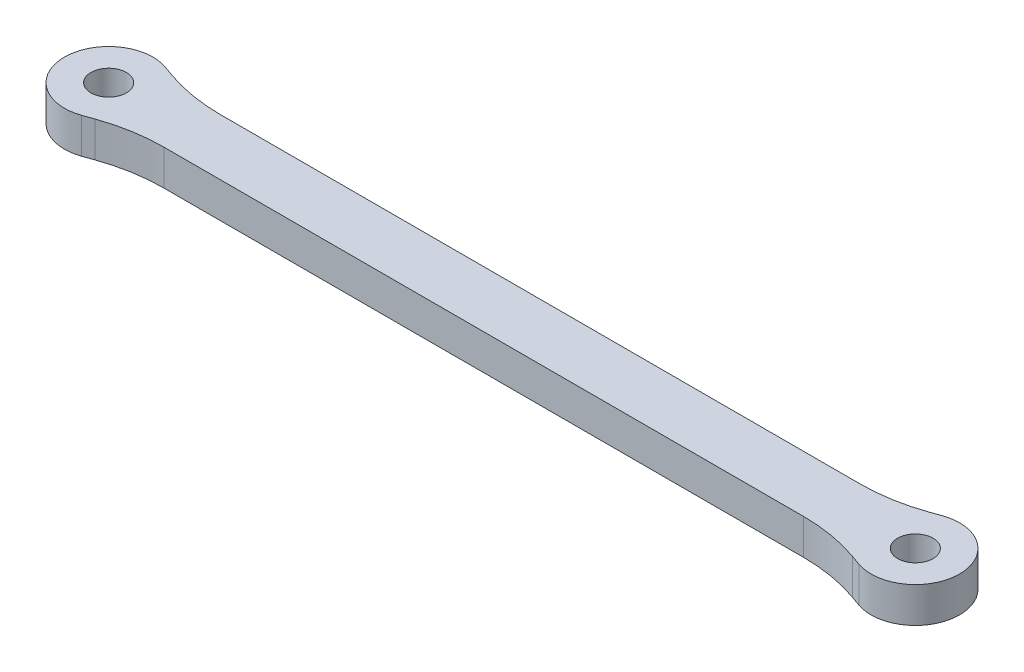
ISO-10303-21;
HEADER;
FILE_DESCRIPTION(('STEP AP214'),'2;1');
FILE_NAME('part.step','',(''),(''),'','','');
FILE_SCHEMA(('AUTOMOTIVE_DESIGN { 1 0 10303 214 1 1 1 1 }'));
ENDSEC;
DATA;
#1=APPLICATION_CONTEXT('core data for automotive mechanical design processes');
#2=APPLICATION_PROTOCOL_DEFINITION('international standard','automotive_design',2000,#1);
#3=PRODUCT_CONTEXT('',#1,'mechanical');
#4=PRODUCT('Part','Part','',(#3));
#5=PRODUCT_RELATED_PRODUCT_CATEGORY('part','',(#4));
#6=PRODUCT_DEFINITION_FORMATION('','',#4);
#7=PRODUCT_DEFINITION_CONTEXT('part definition',#1,'design');
#8=PRODUCT_DEFINITION('design','',#6,#7);
#9=PRODUCT_DEFINITION_SHAPE('','',#8);
#10=(LENGTH_UNIT() NAMED_UNIT(*) SI_UNIT(.MILLI.,.METRE.));
#11=(NAMED_UNIT(*) PLANE_ANGLE_UNIT() SI_UNIT($,.RADIAN.));
#12=(NAMED_UNIT(*) SI_UNIT($,.STERADIAN.) SOLID_ANGLE_UNIT());
#13=UNCERTAINTY_MEASURE_WITH_UNIT(LENGTH_MEASURE(1.E-05),#10,'distance_accuracy_value','');
#14=(GEOMETRIC_REPRESENTATION_CONTEXT(3) GLOBAL_UNCERTAINTY_ASSIGNED_CONTEXT((#13)) GLOBAL_UNIT_ASSIGNED_CONTEXT((#10,
#11,#12)) REPRESENTATION_CONTEXT('',''));
#15=CARTESIAN_POINT('',(0.,0.,0.));
#16=DIRECTION('',(0.,0.,1.));
#17=DIRECTION('',(1.,0.,0.));
#18=AXIS2_PLACEMENT_3D('',#15,#16,#17);
#19=CARTESIAN_POINT('',(45.5,2.,0.));
#20=DIRECTION('',(0.,1.,0.));
#21=DIRECTION('',(0.,0.,1.));
#22=AXIS2_PLACEMENT_3D('',#19,#20,#21);
#23=PLANE('',#22);
#24=CARTESIAN_POINT('',(0.,2.,0.));
#25=DIRECTION('',(0.,1.,0.));
#26=DIRECTION('',(0.,0.,1.));
#27=AXIS2_PLACEMENT_3D('',#24,#25,#26);
#28=CIRCLE('',#27,1.);
#29=CARTESIAN_POINT('',(0.,2.,1.));
#30=VERTEX_POINT('',#29);
#31=EDGE_CURVE('E170',#30,#30,#28,.T.);
#32=ORIENTED_EDGE('',*,*,#31,.F.);
#33=EDGE_LOOP('',(#32));
#34=FACE_BOUND('',#33,.T.);
#35=DIRECTION('',(-0.942809041582064,0.,0.333333333333332));
#36=VECTOR('',#35,1.);
#37=CARTESIAN_POINT('',(42.4996441995921,2.,-1.59086446322915));
#38=LINE('',#37,#36);
#39=CARTESIAN_POINT('',(44.6666666666667,2.,-2.35702260395516));
#40=VERTEX_POINT('',#39);
#41=CARTESIAN_POINT('',(44.1172487803873,2.,-2.16277404740851));
#42=VERTEX_POINT('',#41);
#43=EDGE_CURVE('E164',#40,#42,#38,.T.);
#44=ORIENTED_EDGE('',*,*,#43,.T.);
#45=CARTESIAN_POINT('',(40.783915447054,2.,-11.5908644632291));
#46=DIRECTION('',(0.,1.,0.));
#47=DIRECTION('',(0.,0.,1.));
#48=AXIS2_PLACEMENT_3D('',#45,#46,#47);
#49=CIRCLE('',#48,10.);
#50=CARTESIAN_POINT('',(40.783915447054,2.,-1.59086446322915));
#51=VERTEX_POINT('',#50);
#52=EDGE_CURVE('E215',#42,#51,#49,.F.);
#53=ORIENTED_EDGE('',*,*,#52,.T.);
#54=DIRECTION('',(-1.,0.,0.));
#55=VECTOR('',#54,1.);
#56=CARTESIAN_POINT('',(3.00035580040789,2.,-1.59086446322915));
#57=LINE('',#56,#55);
#58=CARTESIAN_POINT('',(4.71608455294599,2.,-1.59086446322915));
#59=VERTEX_POINT('',#58);
#60=EDGE_CURVE('E138',#51,#59,#57,.T.);
#61=ORIENTED_EDGE('',*,*,#60,.T.);
#62=CARTESIAN_POINT('',(4.71608455294599,2.,-11.5908644632291));
#63=DIRECTION('',(0.,1.,0.));
#64=DIRECTION('',(0.,0.,1.));
#65=AXIS2_PLACEMENT_3D('',#62,#63,#64);
#66=CIRCLE('',#65,10.);
#67=CARTESIAN_POINT('',(1.38275121961265,2.,-2.16277404740852));
#68=VERTEX_POINT('',#67);
#69=EDGE_CURVE('E134',#59,#68,#66,.F.);
#70=ORIENTED_EDGE('',*,*,#69,.T.);
#71=DIRECTION('',(-0.942809041582063,0.,-0.333333333333333));
#72=VECTOR('',#71,1.);
#73=CARTESIAN_POINT('',(0.833333333333333,2.,-2.35702260395516));
#74=LINE('',#73,#72);
#75=CARTESIAN_POINT('',(0.833333333333333,2.,-2.35702260395516));
#76=VERTEX_POINT('',#75);
#77=EDGE_CURVE('E125',#68,#76,#74,.T.);
#78=ORIENTED_EDGE('',*,*,#77,.T.);
#79=CARTESIAN_POINT('',(0.,2.,0.));
#80=DIRECTION('',(0.,1.,0.));
#81=DIRECTION('',(0.,0.,1.));
#82=AXIS2_PLACEMENT_3D('',#79,#80,#81);
#83=CIRCLE('',#82,2.5);
#84=CARTESIAN_POINT('',(0.833333333333333,2.,2.35702260395516));
#85=VERTEX_POINT('',#84);
#86=EDGE_CURVE('E130',#76,#85,#83,.T.);
#87=ORIENTED_EDGE('',*,*,#86,.T.);
#88=DIRECTION('',(0.942809041582063,0.,-0.333333333333334));
#89=VECTOR('',#88,1.);
#90=CARTESIAN_POINT('',(0.833333333333334,2.,2.35702260395516));
#91=LINE('',#90,#89);
#92=CARTESIAN_POINT('',(1.38275121961261,2.,2.16277404740853));
#93=VERTEX_POINT('',#92);
#94=EDGE_CURVE('E152',#85,#93,#91,.T.);
#95=ORIENTED_EDGE('',*,*,#94,.T.);
#96=CARTESIAN_POINT('',(4.71608455294594,2.,11.5908644632292));
#97=DIRECTION('',(0.,1.,0.));
#98=DIRECTION('',(0.,0.,1.));
#99=AXIS2_PLACEMENT_3D('',#96,#97,#98);
#100=CIRCLE('',#99,10.);
#101=CARTESIAN_POINT('',(4.71608455294594,2.,1.59086446322916));
#102=VERTEX_POINT('',#101);
#103=EDGE_CURVE('E11',#93,#102,#100,.F.);
#104=ORIENTED_EDGE('',*,*,#103,.T.);
#105=DIRECTION('',(1.,0.,0.));
#106=VECTOR('',#105,1.);
#107=CARTESIAN_POINT('',(3.00035580040785,2.,1.59086446322916));
#108=LINE('',#107,#106);
#109=CARTESIAN_POINT('',(40.7839154470541,2.,1.59086446322916));
#110=VERTEX_POINT('',#109);
#111=EDGE_CURVE('E154',#102,#110,#108,.T.);
#112=ORIENTED_EDGE('',*,*,#111,.T.);
#113=CARTESIAN_POINT('',(40.7839154470541,2.,11.5908644632292));
#114=DIRECTION('',(0.,1.,0.));
#115=DIRECTION('',(0.,0.,1.));
#116=AXIS2_PLACEMENT_3D('',#113,#114,#115);
#117=CIRCLE('',#116,10.);
#118=CARTESIAN_POINT('',(44.1172487803874,2.,2.16277404740853));
#119=VERTEX_POINT('',#118);
#120=EDGE_CURVE('E211',#110,#119,#117,.F.);
#121=ORIENTED_EDGE('',*,*,#120,.T.);
#122=DIRECTION('',(0.942809041582064,0.,0.333333333333332));
#123=VECTOR('',#122,1.);
#124=CARTESIAN_POINT('',(42.4996441995922,2.,1.59086446322916));
#125=LINE('',#124,#123);
#126=CARTESIAN_POINT('',(44.6666666666667,2.,2.35702260395516));
#127=VERTEX_POINT('',#126);
#128=EDGE_CURVE('E160',#119,#127,#125,.T.);
#129=ORIENTED_EDGE('',*,*,#128,.T.);
#130=CARTESIAN_POINT('',(45.5,2.,0.));
#131=DIRECTION('',(0.,1.,0.));
#132=DIRECTION('',(0.,0.,1.));
#133=AXIS2_PLACEMENT_3D('',#130,#131,#132);
#134=CIRCLE('',#133,2.5);
#135=EDGE_CURVE('E162',#127,#40,#134,.T.);
#136=ORIENTED_EDGE('',*,*,#135,.T.);
#137=EDGE_LOOP('',(#44,#53,#61,#70,#78,#87,#95,#104,#112,#121,#129,#136));
#138=FACE_BOUND('',#137,.T.);
#139=CARTESIAN_POINT('',(45.5,2.,0.));
#140=DIRECTION('',(0.,1.,0.));
#141=DIRECTION('',(0.,0.,1.));
#142=AXIS2_PLACEMENT_3D('',#139,#140,#141);
#143=CIRCLE('',#142,0.999999999999998);
#144=CARTESIAN_POINT('',(45.5,2.,0.999999999999998));
#145=VERTEX_POINT('',#144);
#146=EDGE_CURVE('E303',#145,#145,#143,.T.);
#147=ORIENTED_EDGE('',*,*,#146,.F.);
#148=EDGE_LOOP('',(#147));
#149=FACE_BOUND('',#148,.T.);
#150=ADVANCED_FACE('F37',(#34,#138,#149),#23,.T.);
#151=CARTESIAN_POINT('',(45.5,0.,0.));
#152=DIRECTION('',(0.,1.,0.));
#153=DIRECTION('',(0.,0.,1.));
#154=AXIS2_PLACEMENT_3D('',#151,#152,#153);
#155=PLANE('',#154);
#156=DIRECTION('',(-1.,0.,0.));
#157=VECTOR('',#156,1.);
#158=CARTESIAN_POINT('',(3.00035580040789,0.,-1.59086446322915));
#159=LINE('',#158,#157);
#160=CARTESIAN_POINT('',(40.783915447054,0.,-1.59086446322915));
#161=VERTEX_POINT('',#160);
#162=CARTESIAN_POINT('',(4.71608455294599,0.,-1.59086446322915));
#163=VERTEX_POINT('',#162);
#164=EDGE_CURVE('E167',#161,#163,#159,.T.);
#165=ORIENTED_EDGE('',*,*,#164,.F.);
#166=CARTESIAN_POINT('',(40.783915447054,0.,-11.5908644632291));
#167=DIRECTION('',(0.,1.,0.));
#168=DIRECTION('',(0.,0.,1.));
#169=AXIS2_PLACEMENT_3D('',#166,#167,#168);
#170=CIRCLE('',#169,10.);
#171=CARTESIAN_POINT('',(44.1172487803873,0.,-2.16277404740851));
#172=VERTEX_POINT('',#171);
#173=EDGE_CURVE('E213',#161,#172,#170,.T.);
#174=ORIENTED_EDGE('',*,*,#173,.T.);
#175=DIRECTION('',(-0.942809041582064,0.,0.333333333333332));
#176=VECTOR('',#175,1.);
#177=CARTESIAN_POINT('',(42.4996441995921,0.,-1.59086446322915));
#178=LINE('',#177,#176);
#179=CARTESIAN_POINT('',(44.6666666666667,0.,-2.35702260395516));
#180=VERTEX_POINT('',#179);
#181=EDGE_CURVE('E183',#180,#172,#178,.T.);
#182=ORIENTED_EDGE('',*,*,#181,.F.);
#183=CARTESIAN_POINT('',(45.5,0.,0.));
#184=DIRECTION('',(0.,1.,0.));
#185=DIRECTION('',(0.,0.,1.));
#186=AXIS2_PLACEMENT_3D('',#183,#184,#185);
#187=CIRCLE('',#186,2.5);
#188=CARTESIAN_POINT('',(44.6666666666667,0.,2.35702260395516));
#189=VERTEX_POINT('',#188);
#190=EDGE_CURVE('E181',#189,#180,#187,.T.);
#191=ORIENTED_EDGE('',*,*,#190,.F.);
#192=DIRECTION('',(0.942809041582064,0.,0.333333333333332));
#193=VECTOR('',#192,1.);
#194=CARTESIAN_POINT('',(42.4996441995922,0.,1.59086446322916));
#195=LINE('',#194,#193);
#196=CARTESIAN_POINT('',(44.1172487803874,0.,2.16277404740853));
#197=VERTEX_POINT('',#196);
#198=EDGE_CURVE('E179',#197,#189,#195,.T.);
#199=ORIENTED_EDGE('',*,*,#198,.F.);
#200=CARTESIAN_POINT('',(40.7839154470541,0.,11.5908644632292));
#201=DIRECTION('',(0.,1.,0.));
#202=DIRECTION('',(0.,0.,1.));
#203=AXIS2_PLACEMENT_3D('',#200,#201,#202);
#204=CIRCLE('',#203,10.);
#205=CARTESIAN_POINT('',(40.7839154470541,0.,1.59086446322916));
#206=VERTEX_POINT('',#205);
#207=EDGE_CURVE('E209',#197,#206,#204,.T.);
#208=ORIENTED_EDGE('',*,*,#207,.T.);
#209=DIRECTION('',(1.,0.,0.));
#210=VECTOR('',#209,1.);
#211=CARTESIAN_POINT('',(3.00035580040785,0.,1.59086446322916));
#212=LINE('',#211,#210);
#213=CARTESIAN_POINT('',(4.71608455294594,0.,1.59086446322916));
#214=VERTEX_POINT('',#213);
#215=EDGE_CURVE('E176',#214,#206,#212,.T.);
#216=ORIENTED_EDGE('',*,*,#215,.F.);
#217=CARTESIAN_POINT('',(4.71608455294594,0.,11.5908644632292));
#218=DIRECTION('',(0.,1.,0.));
#219=DIRECTION('',(0.,0.,1.));
#220=AXIS2_PLACEMENT_3D('',#217,#218,#219);
#221=CIRCLE('',#220,10.);
#222=CARTESIAN_POINT('',(1.38275121961261,0.,2.16277404740853));
#223=VERTEX_POINT('',#222);
#224=EDGE_CURVE('E45',#214,#223,#221,.T.);
#225=ORIENTED_EDGE('',*,*,#224,.T.);
#226=DIRECTION('',(0.942809041582063,0.,-0.333333333333334));
#227=VECTOR('',#226,1.);
#228=CARTESIAN_POINT('',(0.833333333333334,0.,2.35702260395516));
#229=LINE('',#228,#227);
#230=CARTESIAN_POINT('',(0.833333333333333,0.,2.35702260395516));
#231=VERTEX_POINT('',#230);
#232=EDGE_CURVE('E174',#231,#223,#229,.T.);
#233=ORIENTED_EDGE('',*,*,#232,.F.);
#234=CARTESIAN_POINT('',(0.,0.,0.));
#235=DIRECTION('',(0.,1.,0.));
#236=DIRECTION('',(0.,0.,1.));
#237=AXIS2_PLACEMENT_3D('',#234,#235,#236);
#238=CIRCLE('',#237,2.5);
#239=CARTESIAN_POINT('',(0.833333333333333,0.,-2.35702260395516));
#240=VERTEX_POINT('',#239);
#241=EDGE_CURVE('E172',#240,#231,#238,.T.);
#242=ORIENTED_EDGE('',*,*,#241,.F.);
#243=DIRECTION('',(-0.942809041582063,0.,-0.333333333333333));
#244=VECTOR('',#243,1.);
#245=CARTESIAN_POINT('',(0.833333333333333,0.,-2.35702260395516));
#246=LINE('',#245,#244);
#247=CARTESIAN_POINT('',(1.38275121961265,0.,-2.16277404740852));
#248=VERTEX_POINT('',#247);
#249=EDGE_CURVE('E144',#248,#240,#246,.T.);
#250=ORIENTED_EDGE('',*,*,#249,.F.);
#251=CARTESIAN_POINT('',(4.71608455294599,0.,-11.5908644632291));
#252=DIRECTION('',(0.,1.,0.));
#253=DIRECTION('',(0.,0.,1.));
#254=AXIS2_PLACEMENT_3D('',#251,#252,#253);
#255=CIRCLE('',#254,10.);
#256=EDGE_CURVE('E217',#248,#163,#255,.T.);
#257=ORIENTED_EDGE('',*,*,#256,.T.);
#258=EDGE_LOOP('',(#165,#174,#182,#191,#199,#208,#216,#225,#233,#242,#250,#257));
#259=FACE_BOUND('',#258,.T.);
#260=CARTESIAN_POINT('',(0.,0.,0.));
#261=DIRECTION('',(0.,1.,0.));
#262=DIRECTION('',(0.,0.,1.));
#263=AXIS2_PLACEMENT_3D('',#260,#261,#262);
#264=CIRCLE('',#263,1.);
#265=CARTESIAN_POINT('',(0.,0.,1.));
#266=VERTEX_POINT('',#265);
#267=EDGE_CURVE('E300',#266,#266,#264,.T.);
#268=ORIENTED_EDGE('',*,*,#267,.T.);
#269=EDGE_LOOP('',(#268));
#270=FACE_BOUND('',#269,.T.);
#271=CARTESIAN_POINT('',(45.5,0.,0.));
#272=DIRECTION('',(0.,1.,0.));
#273=DIRECTION('',(0.,0.,1.));
#274=AXIS2_PLACEMENT_3D('',#271,#272,#273);
#275=CIRCLE('',#274,0.999999999999998);
#276=CARTESIAN_POINT('',(45.5,0.,0.999999999999998));
#277=VERTEX_POINT('',#276);
#278=EDGE_CURVE('E306',#277,#277,#275,.T.);
#279=ORIENTED_EDGE('',*,*,#278,.T.);
#280=EDGE_LOOP('',(#279));
#281=FACE_BOUND('',#280,.T.);
#282=ADVANCED_FACE('F220',(#259,#270,#281),#155,.F.);
#283=CARTESIAN_POINT('',(3.00035580040789,2.,-1.59086446322915));
#284=DIRECTION('',(0.,0.,1.));
#285=DIRECTION('',(1.,0.,0.));
#286=AXIS2_PLACEMENT_3D('',#283,#284,#285);
#287=PLANE('',#286);
#288=ORIENTED_EDGE('',*,*,#60,.F.);
#289=DIRECTION('',(0.,-1.,0.));
#290=VECTOR('',#289,1.);
#291=CARTESIAN_POINT('',(40.783915447054,0.,-1.59086446322915));
#292=LINE('',#291,#290);
#293=EDGE_CURVE('E201',#51,#161,#292,.T.);
#294=ORIENTED_EDGE('',*,*,#293,.T.);
#295=ORIENTED_EDGE('',*,*,#164,.T.);
#296=DIRECTION('',(0.,-1.,0.));
#297=VECTOR('',#296,1.);
#298=CARTESIAN_POINT('',(4.71608455294599,2.,-1.59086446322915));
#299=LINE('',#298,#297);
#300=EDGE_CURVE('E199',#163,#59,#299,.F.);
#301=ORIENTED_EDGE('',*,*,#300,.T.);
#302=EDGE_LOOP('',(#288,#294,#295,#301));
#303=FACE_BOUND('',#302,.T.);
#304=ADVANCED_FACE('F226',(#303),#287,.F.);
#305=CARTESIAN_POINT('',(0.833333333333333,2.,-2.35702260395516));
#306=DIRECTION('',(-0.333333333333333,0.,0.942809041582063));
#307=DIRECTION('',(0.942809041582063,0.,0.333333333333334));
#308=AXIS2_PLACEMENT_3D('',#305,#306,#307);
#309=PLANE('',#308);
#310=ORIENTED_EDGE('',*,*,#77,.F.);
#311=DIRECTION('',(0.,-1.,0.));
#312=VECTOR('',#311,1.);
#313=CARTESIAN_POINT('',(1.38275121961265,0.,-2.16277404740852));
#314=LINE('',#313,#312);
#315=EDGE_CURVE('E206',#68,#248,#314,.T.);
#316=ORIENTED_EDGE('',*,*,#315,.T.);
#317=ORIENTED_EDGE('',*,*,#249,.T.);
#318=DIRECTION('',(0.,-1.,0.));
#319=VECTOR('',#318,1.);
#320=CARTESIAN_POINT('',(0.833333333333333,2.,-2.35702260395516));
#321=LINE('',#320,#319);
#322=EDGE_CURVE('E141',#76,#240,#321,.T.);
#323=ORIENTED_EDGE('',*,*,#322,.F.);
#324=EDGE_LOOP('',(#310,#316,#317,#323));
#325=FACE_BOUND('',#324,.T.);
#326=ADVANCED_FACE('F142',(#325),#309,.F.);
#327=CARTESIAN_POINT('',(0.,2.,0.));
#328=DIRECTION('',(0.,-1.,0.));
#329=DIRECTION('',(0.,0.,-1.));
#330=AXIS2_PLACEMENT_3D('',#327,#328,#329);
#331=CYLINDRICAL_SURFACE('',#330,2.5);
#332=ORIENTED_EDGE('',*,*,#241,.T.);
#333=DIRECTION('',(0.,-1.,0.));
#334=VECTOR('',#333,1.);
#335=CARTESIAN_POINT('',(0.833333333333333,2.,2.35702260395516));
#336=LINE('',#335,#334);
#337=EDGE_CURVE('E148',#85,#231,#336,.T.);
#338=ORIENTED_EDGE('',*,*,#337,.F.);
#339=ORIENTED_EDGE('',*,*,#86,.F.);
#340=ORIENTED_EDGE('',*,*,#322,.T.);
#341=EDGE_LOOP('',(#332,#338,#339,#340));
#342=FACE_BOUND('',#341,.T.);
#343=ADVANCED_FACE('F150',(#342),#331,.T.);
#344=CARTESIAN_POINT('',(0.833333333333334,2.,2.35702260395516));
#345=DIRECTION('',(-0.333333333333334,0.,-0.942809041582063));
#346=DIRECTION('',(-0.942809041582063,0.,0.333333333333334));
#347=AXIS2_PLACEMENT_3D('',#344,#345,#346);
#348=PLANE('',#347);
#349=ORIENTED_EDGE('',*,*,#232,.T.);
#350=DIRECTION('',(0.,-1.,0.));
#351=VECTOR('',#350,1.);
#352=CARTESIAN_POINT('',(1.38275121961261,2.,2.16277404740853));
#353=LINE('',#352,#351);
#354=EDGE_CURVE('E52',#223,#93,#353,.F.);
#355=ORIENTED_EDGE('',*,*,#354,.T.);
#356=ORIENTED_EDGE('',*,*,#94,.F.);
#357=ORIENTED_EDGE('',*,*,#337,.T.);
#358=EDGE_LOOP('',(#349,#355,#356,#357));
#359=FACE_BOUND('',#358,.T.);
#360=ADVANCED_FACE('F266',(#359),#348,.F.);
#361=CARTESIAN_POINT('',(3.00035580040785,2.,1.59086446322916));
#362=DIRECTION('',(0.,0.,-1.));
#363=DIRECTION('',(-1.,0.,0.));
#364=AXIS2_PLACEMENT_3D('',#361,#362,#363);
#365=PLANE('',#364);
#366=ORIENTED_EDGE('',*,*,#215,.T.);
#367=DIRECTION('',(0.,-1.,0.));
#368=VECTOR('',#367,1.);
#369=CARTESIAN_POINT('',(40.7839154470541,2.,1.59086446322916));
#370=LINE('',#369,#368);
#371=EDGE_CURVE('E197',#206,#110,#370,.F.);
#372=ORIENTED_EDGE('',*,*,#371,.T.);
#373=ORIENTED_EDGE('',*,*,#111,.F.);
#374=DIRECTION('',(0.,-1.,0.));
#375=VECTOR('',#374,1.);
#376=CARTESIAN_POINT('',(4.71608455294594,0.,1.59086446322916));
#377=LINE('',#376,#375);
#378=EDGE_CURVE('E194',#102,#214,#377,.T.);
#379=ORIENTED_EDGE('',*,*,#378,.T.);
#380=EDGE_LOOP('',(#366,#372,#373,#379));
#381=FACE_BOUND('',#380,.T.);
#382=ADVANCED_FACE('F262',(#381),#365,.F.);
#383=CARTESIAN_POINT('',(42.4996441995922,2.,1.59086446322916));
#384=DIRECTION('',(0.333333333333332,0.,-0.942809041582064));
#385=DIRECTION('',(-0.942809041582064,0.,-0.333333333333332));
#386=AXIS2_PLACEMENT_3D('',#383,#384,#385);
#387=PLANE('',#386);
#388=ORIENTED_EDGE('',*,*,#128,.F.);
#389=DIRECTION('',(0.,-1.,0.));
#390=VECTOR('',#389,1.);
#391=CARTESIAN_POINT('',(44.1172487803874,0.,2.16277404740853));
#392=LINE('',#391,#390);
#393=EDGE_CURVE('E147',#119,#197,#392,.T.);
#394=ORIENTED_EDGE('',*,*,#393,.T.);
#395=ORIENTED_EDGE('',*,*,#198,.T.);
#396=DIRECTION('',(0.,-1.,0.));
#397=VECTOR('',#396,1.);
#398=CARTESIAN_POINT('',(44.6666666666667,2.,2.35702260395516));
#399=LINE('',#398,#397);
#400=EDGE_CURVE('E188',#127,#189,#399,.T.);
#401=ORIENTED_EDGE('',*,*,#400,.F.);
#402=EDGE_LOOP('',(#388,#394,#395,#401));
#403=FACE_BOUND('',#402,.T.);
#404=ADVANCED_FACE('F258',(#403),#387,.F.);
#405=CARTESIAN_POINT('',(45.5,2.,0.));
#406=DIRECTION('',(0.,-1.,0.));
#407=DIRECTION('',(0.,0.,-1.));
#408=AXIS2_PLACEMENT_3D('',#405,#406,#407);
#409=CYLINDRICAL_SURFACE('',#408,2.5);
#410=ORIENTED_EDGE('',*,*,#190,.T.);
#411=DIRECTION('',(0.,-1.,0.));
#412=VECTOR('',#411,1.);
#413=CARTESIAN_POINT('',(44.6666666666667,2.,-2.35702260395516));
#414=LINE('',#413,#412);
#415=EDGE_CURVE('E166',#40,#180,#414,.T.);
#416=ORIENTED_EDGE('',*,*,#415,.F.);
#417=ORIENTED_EDGE('',*,*,#135,.F.);
#418=ORIENTED_EDGE('',*,*,#400,.T.);
#419=EDGE_LOOP('',(#410,#416,#417,#418));
#420=FACE_BOUND('',#419,.T.);
#421=ADVANCED_FACE('F254',(#420),#409,.T.);
#422=CARTESIAN_POINT('',(42.4996441995921,2.,-1.59086446322915));
#423=DIRECTION('',(0.333333333333332,0.,0.942809041582064));
#424=DIRECTION('',(0.942809041582064,0.,-0.333333333333332));
#425=AXIS2_PLACEMENT_3D('',#422,#423,#424);
#426=PLANE('',#425);
#427=ORIENTED_EDGE('',*,*,#181,.T.);
#428=DIRECTION('',(0.,-1.,0.));
#429=VECTOR('',#428,1.);
#430=CARTESIAN_POINT('',(44.1172487803873,2.,-2.16277404740851));
#431=LINE('',#430,#429);
#432=EDGE_CURVE('E204',#172,#42,#431,.F.);
#433=ORIENTED_EDGE('',*,*,#432,.T.);
#434=ORIENTED_EDGE('',*,*,#43,.F.);
#435=ORIENTED_EDGE('',*,*,#415,.T.);
#436=EDGE_LOOP('',(#427,#433,#434,#435));
#437=FACE_BOUND('',#436,.T.);
#438=ADVANCED_FACE('F251',(#437),#426,.F.);
#439=CARTESIAN_POINT('',(0.,2.,0.));
#440=DIRECTION('',(0.,-1.,0.));
#441=DIRECTION('',(0.,0.,-1.));
#442=AXIS2_PLACEMENT_3D('',#439,#440,#441);
#443=CYLINDRICAL_SURFACE('',#442,1.);
#444=ORIENTED_EDGE('',*,*,#31,.T.);
#445=EDGE_LOOP('',(#444));
#446=FACE_BOUND('',#445,.T.);
#447=ORIENTED_EDGE('',*,*,#267,.F.);
#448=EDGE_LOOP('',(#447));
#449=FACE_BOUND('',#448,.T.);
#450=ADVANCED_FACE('F248',(#446,#449),#443,.F.);
#451=CARTESIAN_POINT('',(45.5,2.,0.));
#452=DIRECTION('',(0.,-1.,0.));
#453=DIRECTION('',(0.,0.,-1.));
#454=AXIS2_PLACEMENT_3D('',#451,#452,#453);
#455=CYLINDRICAL_SURFACE('',#454,0.999999999999998);
#456=ORIENTED_EDGE('',*,*,#146,.T.);
#457=EDGE_LOOP('',(#456));
#458=FACE_BOUND('',#457,.T.);
#459=ORIENTED_EDGE('',*,*,#278,.F.);
#460=EDGE_LOOP('',(#459));
#461=FACE_BOUND('',#460,.T.);
#462=ADVANCED_FACE('F277',(#458,#461),#455,.F.);
#463=CARTESIAN_POINT('',(40.7839154470541,2.,11.5908644632292));
#464=DIRECTION('',(0.,1.,0.));
#465=DIRECTION('',(0.,0.,1.));
#466=AXIS2_PLACEMENT_3D('',#463,#464,#465);
#467=CYLINDRICAL_SURFACE('',#466,10.);
#468=ORIENTED_EDGE('',*,*,#120,.F.);
#469=ORIENTED_EDGE('',*,*,#371,.F.);
#470=ORIENTED_EDGE('',*,*,#207,.F.);
#471=ORIENTED_EDGE('',*,*,#393,.F.);
#472=EDGE_LOOP('',(#468,#469,#470,#471));
#473=FACE_BOUND('',#472,.T.);
#474=ADVANCED_FACE('F236',(#473),#467,.F.);
#475=CARTESIAN_POINT('',(40.783915447054,2.,-11.5908644632291));
#476=DIRECTION('',(0.,1.,0.));
#477=DIRECTION('',(0.,0.,1.));
#478=AXIS2_PLACEMENT_3D('',#475,#476,#477);
#479=CYLINDRICAL_SURFACE('',#478,10.);
#480=ORIENTED_EDGE('',*,*,#52,.F.);
#481=ORIENTED_EDGE('',*,*,#432,.F.);
#482=ORIENTED_EDGE('',*,*,#173,.F.);
#483=ORIENTED_EDGE('',*,*,#293,.F.);
#484=EDGE_LOOP('',(#480,#481,#482,#483));
#485=FACE_BOUND('',#484,.T.);
#486=ADVANCED_FACE('F230',(#485),#479,.F.);
#487=CARTESIAN_POINT('',(4.71608455294599,2.,-11.5908644632291));
#488=DIRECTION('',(0.,1.,0.));
#489=DIRECTION('',(0.,0.,1.));
#490=AXIS2_PLACEMENT_3D('',#487,#488,#489);
#491=CYLINDRICAL_SURFACE('',#490,10.);
#492=ORIENTED_EDGE('',*,*,#69,.F.);
#493=ORIENTED_EDGE('',*,*,#300,.F.);
#494=ORIENTED_EDGE('',*,*,#256,.F.);
#495=ORIENTED_EDGE('',*,*,#315,.F.);
#496=EDGE_LOOP('',(#492,#493,#494,#495));
#497=FACE_BOUND('',#496,.T.);
#498=ADVANCED_FACE('F228',(#497),#491,.F.);
#499=CARTESIAN_POINT('',(4.71608455294594,2.,11.5908644632292));
#500=DIRECTION('',(0.,1.,0.));
#501=DIRECTION('',(0.,0.,1.));
#502=AXIS2_PLACEMENT_3D('',#499,#500,#501);
#503=CYLINDRICAL_SURFACE('',#502,10.);
#504=ORIENTED_EDGE('',*,*,#103,.F.);
#505=ORIENTED_EDGE('',*,*,#354,.F.);
#506=ORIENTED_EDGE('',*,*,#224,.F.);
#507=ORIENTED_EDGE('',*,*,#378,.F.);
#508=EDGE_LOOP('',(#504,#505,#506,#507));
#509=FACE_BOUND('',#508,.T.);
#510=ADVANCED_FACE('F39',(#509),#503,.F.);
#511=CLOSED_SHELL('',(#150,#282,#304,#326,#343,#360,#382,#404,#421,#438,#450,#462,#474,#486,
#498,#510));
#512=MANIFOLD_SOLID_BREP('B2',#511);
#513=ADVANCED_BREP_SHAPE_REPRESENTATION('',(#18,#512),#14);
#514=SHAPE_DEFINITION_REPRESENTATION(#9,#513);
ENDSEC;
END-ISO-10303-21;
